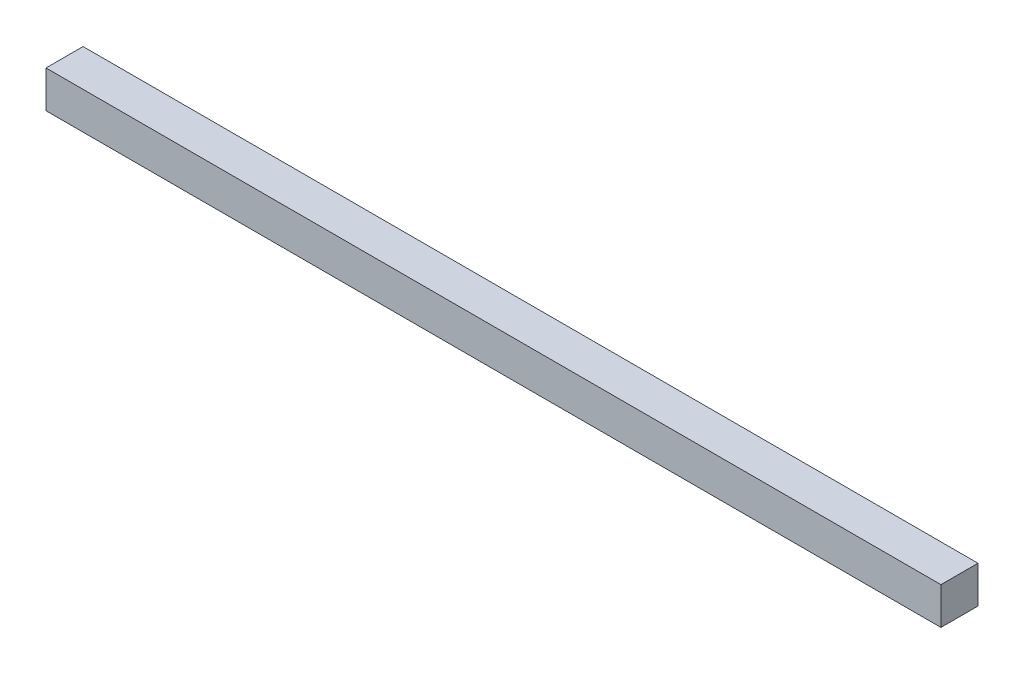
ISO-10303-21;
HEADER;
FILE_DESCRIPTION(('STEP AP214'),'2;1');
FILE_NAME('part.step','',(''),(''),'','','');
FILE_SCHEMA(('AUTOMOTIVE_DESIGN { 1 0 10303 214 1 1 1 1 }'));
ENDSEC;
DATA;
#1=APPLICATION_CONTEXT('core data for automotive mechanical design processes');
#2=APPLICATION_PROTOCOL_DEFINITION('international standard','automotive_design',2000,#1);
#3=PRODUCT_CONTEXT('',#1,'mechanical');
#4=PRODUCT('Part','Part','',(#3));
#5=PRODUCT_RELATED_PRODUCT_CATEGORY('part','',(#4));
#6=PRODUCT_DEFINITION_FORMATION('','',#4);
#7=PRODUCT_DEFINITION_CONTEXT('part definition',#1,'design');
#8=PRODUCT_DEFINITION('design','',#6,#7);
#9=PRODUCT_DEFINITION_SHAPE('','',#8);
#10=(LENGTH_UNIT() NAMED_UNIT(*) SI_UNIT(.MILLI.,.METRE.));
#11=(NAMED_UNIT(*) PLANE_ANGLE_UNIT() SI_UNIT($,.RADIAN.));
#12=(NAMED_UNIT(*) SI_UNIT($,.STERADIAN.) SOLID_ANGLE_UNIT());
#13=UNCERTAINTY_MEASURE_WITH_UNIT(LENGTH_MEASURE(1.E-05),#10,'distance_accuracy_value','');
#14=(GEOMETRIC_REPRESENTATION_CONTEXT(3) GLOBAL_UNCERTAINTY_ASSIGNED_CONTEXT((#13)) GLOBAL_UNIT_ASSIGNED_CONTEXT((#10,
#11,#12)) REPRESENTATION_CONTEXT('',''));
#15=CARTESIAN_POINT('',(0.,0.,0.));
#16=DIRECTION('',(0.,0.,1.));
#17=DIRECTION('',(1.,0.,0.));
#18=AXIS2_PLACEMENT_3D('',#15,#16,#17);
#19=CARTESIAN_POINT('',(482.8,-20.0000000000001,0.));
#20=DIRECTION('',(0.,1.,0.));
#21=DIRECTION('',(0.,0.,1.));
#22=AXIS2_PLACEMENT_3D('',#19,#20,#21);
#23=PLANE('',#22);
#24=DIRECTION('',(1.,0.,0.));
#25=VECTOR('',#24,1.);
#26=CARTESIAN_POINT('',(482.8,-20.,-20.));
#27=LINE('',#26,#25);
#28=CARTESIAN_POINT('',(0.,-20.,-20.));
#29=VERTEX_POINT('',#28);
#30=CARTESIAN_POINT('',(965.6,-20.0000000000001,-20.));
#31=VERTEX_POINT('',#30);
#32=EDGE_CURVE('E74',#29,#31,#27,.T.);
#33=ORIENTED_EDGE('',*,*,#32,.T.);
#34=DIRECTION('',(0.,0.,1.));
#35=VECTOR('',#34,1.);
#36=CARTESIAN_POINT('',(965.6,-20.0000000000002,0.));
#37=LINE('',#36,#35);
#38=CARTESIAN_POINT('',(965.6,-20.0000000000001,20.));
#39=VERTEX_POINT('',#38);
#40=EDGE_CURVE('E56',#31,#39,#37,.T.);
#41=ORIENTED_EDGE('',*,*,#40,.T.);
#42=DIRECTION('',(1.,0.,0.));
#43=VECTOR('',#42,1.);
#44=CARTESIAN_POINT('',(482.8,-20.,20.));
#45=LINE('',#44,#43);
#46=CARTESIAN_POINT('',(0.,-20.,20.));
#47=VERTEX_POINT('',#46);
#48=EDGE_CURVE('E18',#47,#39,#45,.T.);
#49=ORIENTED_EDGE('',*,*,#48,.F.);
#50=DIRECTION('',(0.,0.,1.));
#51=VECTOR('',#50,1.);
#52=CARTESIAN_POINT('',(0.,-20.,0.));
#53=LINE('',#52,#51);
#54=EDGE_CURVE('E53',#47,#29,#53,.F.);
#55=ORIENTED_EDGE('',*,*,#54,.T.);
#56=EDGE_LOOP('',(#33,#41,#49,#55));
#57=FACE_BOUND('',#56,.T.);
#58=ADVANCED_FACE('F15',(#57),#23,.F.);
#59=CARTESIAN_POINT('',(482.8,0.,20.));
#60=DIRECTION('',(0.,0.,1.));
#61=DIRECTION('',(1.,0.,0.));
#62=AXIS2_PLACEMENT_3D('',#59,#60,#61);
#63=PLANE('',#62);
#64=DIRECTION('',(1.,0.,0.));
#65=VECTOR('',#64,1.);
#66=CARTESIAN_POINT('',(482.8,19.9999999999999,20.));
#67=LINE('',#66,#65);
#68=CARTESIAN_POINT('',(965.6,19.9999999999998,20.));
#69=VERTEX_POINT('',#68);
#70=CARTESIAN_POINT('',(0.,19.9999999999999,20.));
#71=VERTEX_POINT('',#70);
#72=EDGE_CURVE('E71',#69,#71,#67,.F.);
#73=ORIENTED_EDGE('',*,*,#72,.T.);
#74=DIRECTION('',(0.,1.,0.));
#75=VECTOR('',#74,1.);
#76=CARTESIAN_POINT('',(0.,0.,20.));
#77=LINE('',#76,#75);
#78=EDGE_CURVE('E61',#71,#47,#77,.F.);
#79=ORIENTED_EDGE('',*,*,#78,.T.);
#80=ORIENTED_EDGE('',*,*,#48,.T.);
#81=DIRECTION('',(0.,-1.,0.));
#82=VECTOR('',#81,1.);
#83=CARTESIAN_POINT('',(965.6,-1.77371984287633E-13,20.));
#84=LINE('',#83,#82);
#85=EDGE_CURVE('E76',#39,#69,#84,.F.);
#86=ORIENTED_EDGE('',*,*,#85,.T.);
#87=EDGE_LOOP('',(#73,#79,#80,#86));
#88=FACE_BOUND('',#87,.T.);
#89=ADVANCED_FACE('F70',(#88),#63,.T.);
#90=CARTESIAN_POINT('',(0.,0.,0.));
#91=DIRECTION('',(1.,0.,0.));
#92=DIRECTION('',(0.,1.,0.));
#93=AXIS2_PLACEMENT_3D('',#90,#91,#92);
#94=PLANE('',#93);
#95=DIRECTION('',(0.,1.,0.));
#96=VECTOR('',#95,1.);
#97=CARTESIAN_POINT('',(0.,0.,-20.));
#98=LINE('',#97,#96);
#99=CARTESIAN_POINT('',(0.,20.,-20.));
#100=VERTEX_POINT('',#99);
#101=EDGE_CURVE('E67',#100,#29,#98,.F.);
#102=ORIENTED_EDGE('',*,*,#101,.T.);
#103=ORIENTED_EDGE('',*,*,#54,.F.);
#104=ORIENTED_EDGE('',*,*,#78,.F.);
#105=DIRECTION('',(0.,0.,1.));
#106=VECTOR('',#105,1.);
#107=CARTESIAN_POINT('',(0.,20.,0.));
#108=LINE('',#107,#106);
#109=EDGE_CURVE('E81',#71,#100,#108,.F.);
#110=ORIENTED_EDGE('',*,*,#109,.T.);
#111=EDGE_LOOP('',(#102,#103,#104,#110));
#112=FACE_BOUND('',#111,.T.);
#113=ADVANCED_FACE('F64',(#112),#94,.F.);
#114=CARTESIAN_POINT('',(482.8,0.,-20.));
#115=DIRECTION('',(0.,0.,1.));
#116=DIRECTION('',(1.,0.,0.));
#117=AXIS2_PLACEMENT_3D('',#114,#115,#116);
#118=PLANE('',#117);
#119=ORIENTED_EDGE('',*,*,#101,.F.);
#120=DIRECTION('',(1.,0.,0.));
#121=VECTOR('',#120,1.);
#122=CARTESIAN_POINT('',(482.8,19.9999999999999,-20.));
#123=LINE('',#122,#121);
#124=CARTESIAN_POINT('',(965.6,19.9999999999998,-20.));
#125=VERTEX_POINT('',#124);
#126=EDGE_CURVE('E24',#100,#125,#123,.T.);
#127=ORIENTED_EDGE('',*,*,#126,.T.);
#128=DIRECTION('',(0.,-1.,0.));
#129=VECTOR('',#128,1.);
#130=CARTESIAN_POINT('',(965.6,-1.77371984287633E-13,-20.));
#131=LINE('',#130,#129);
#132=EDGE_CURVE('E32',#125,#31,#131,.T.);
#133=ORIENTED_EDGE('',*,*,#132,.T.);
#134=ORIENTED_EDGE('',*,*,#32,.F.);
#135=EDGE_LOOP('',(#119,#127,#133,#134));
#136=FACE_BOUND('',#135,.T.);
#137=ADVANCED_FACE('F86',(#136),#118,.F.);
#138=CARTESIAN_POINT('',(965.6,-1.77371984287633E-13,0.));
#139=DIRECTION('',(-1.,0.,0.));
#140=DIRECTION('',(0.,-1.,0.));
#141=AXIS2_PLACEMENT_3D('',#138,#139,#140);
#142=PLANE('',#141);
#143=ORIENTED_EDGE('',*,*,#132,.F.);
#144=DIRECTION('',(0.,0.,1.));
#145=VECTOR('',#144,1.);
#146=CARTESIAN_POINT('',(965.6,19.9999999999998,0.));
#147=LINE('',#146,#145);
#148=EDGE_CURVE('E10',#125,#69,#147,.T.);
#149=ORIENTED_EDGE('',*,*,#148,.T.);
#150=ORIENTED_EDGE('',*,*,#85,.F.);
#151=ORIENTED_EDGE('',*,*,#40,.F.);
#152=EDGE_LOOP('',(#143,#149,#150,#151));
#153=FACE_BOUND('',#152,.T.);
#154=ADVANCED_FACE('F89',(#153),#142,.F.);
#155=CARTESIAN_POINT('',(482.8,19.9999999999999,0.));
#156=DIRECTION('',(0.,-1.,0.));
#157=DIRECTION('',(1.,0.,0.));
#158=AXIS2_PLACEMENT_3D('',#155,#156,#157);
#159=PLANE('',#158);
#160=ORIENTED_EDGE('',*,*,#126,.F.);
#161=ORIENTED_EDGE('',*,*,#109,.F.);
#162=ORIENTED_EDGE('',*,*,#72,.F.);
#163=ORIENTED_EDGE('',*,*,#148,.F.);
#164=EDGE_LOOP('',(#160,#161,#162,#163));
#165=FACE_BOUND('',#164,.T.);
#166=ADVANCED_FACE('F88',(#165),#159,.F.);
#167=CLOSED_SHELL('',(#58,#89,#113,#137,#154,#166));
#168=MANIFOLD_SOLID_BREP('B1',#167);
#169=ADVANCED_BREP_SHAPE_REPRESENTATION('',(#18,#168),#14);
#170=SHAPE_DEFINITION_REPRESENTATION(#9,#169);
ENDSEC;
END-ISO-10303-21;
